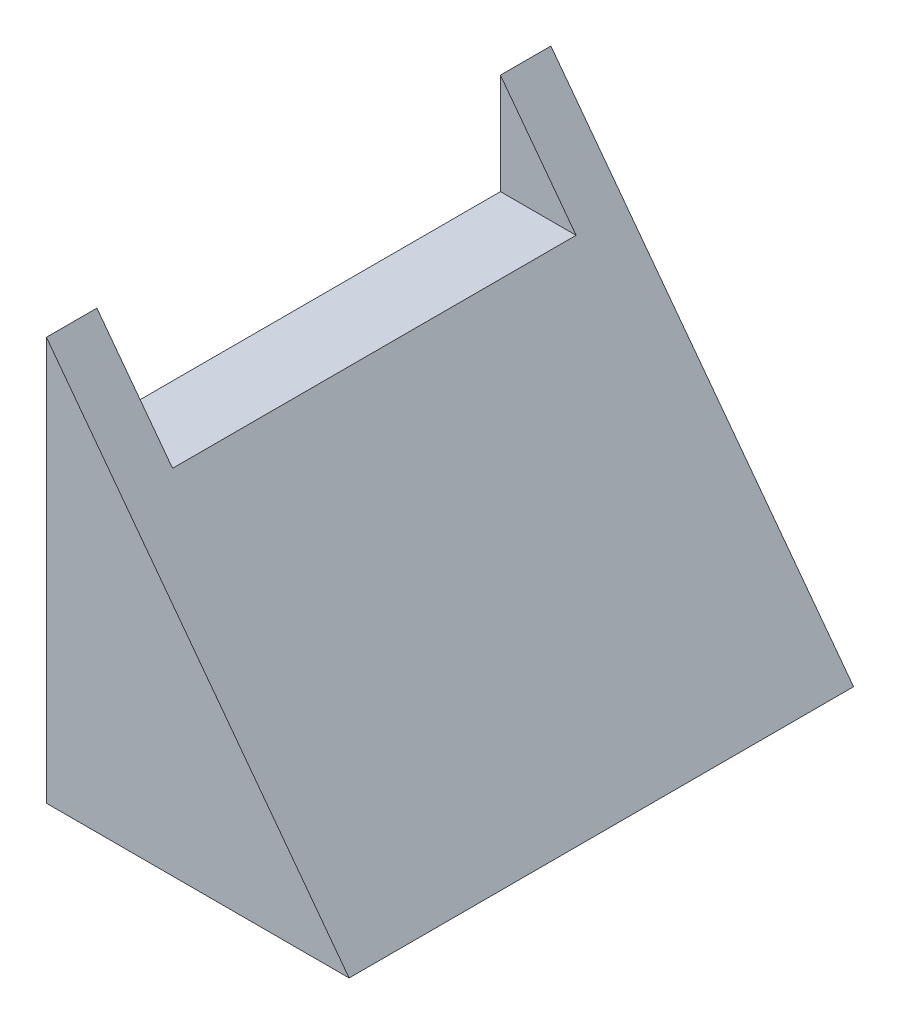
ISO-10303-21;
HEADER;
FILE_DESCRIPTION(('STEP AP214'),'2;1');
FILE_NAME('part.step','',(''),(''),'','','');
FILE_SCHEMA(('AUTOMOTIVE_DESIGN { 1 0 10303 214 1 1 1 1 }'));
ENDSEC;
DATA;
#1=APPLICATION_CONTEXT('core data for automotive mechanical design processes');
#2=APPLICATION_PROTOCOL_DEFINITION('international standard','automotive_design',2000,#1);
#3=PRODUCT_CONTEXT('',#1,'mechanical');
#4=PRODUCT('Part','Part','',(#3));
#5=PRODUCT_RELATED_PRODUCT_CATEGORY('part','',(#4));
#6=PRODUCT_DEFINITION_FORMATION('','',#4);
#7=PRODUCT_DEFINITION_CONTEXT('part definition',#1,'design');
#8=PRODUCT_DEFINITION('design','',#6,#7);
#9=PRODUCT_DEFINITION_SHAPE('','',#8);
#10=(LENGTH_UNIT() NAMED_UNIT(*) SI_UNIT(.MILLI.,.METRE.));
#11=(NAMED_UNIT(*) PLANE_ANGLE_UNIT() SI_UNIT($,.RADIAN.));
#12=(NAMED_UNIT(*) SI_UNIT($,.STERADIAN.) SOLID_ANGLE_UNIT());
#13=UNCERTAINTY_MEASURE_WITH_UNIT(LENGTH_MEASURE(1.E-05),#10,'distance_accuracy_value','');
#14=(GEOMETRIC_REPRESENTATION_CONTEXT(3) GLOBAL_UNCERTAINTY_ASSIGNED_CONTEXT((#13)) GLOBAL_UNIT_ASSIGNED_CONTEXT((#10,
#11,#12)) REPRESENTATION_CONTEXT('',''));
#15=CARTESIAN_POINT('',(0.,0.,0.));
#16=DIRECTION('',(0.,0.,1.));
#17=DIRECTION('',(1.,0.,0.));
#18=AXIS2_PLACEMENT_3D('',#15,#16,#17);
#19=CARTESIAN_POINT('',(-19.05,0.,63.5));
#20=DIRECTION('',(1.,0.,0.));
#21=DIRECTION('',(0.,1.,0.));
#22=AXIS2_PLACEMENT_3D('',#19,#20,#21);
#23=PLANE('',#22);
#24=DIRECTION('',(0.,0.,-1.));
#25=VECTOR('',#24,1.);
#26=CARTESIAN_POINT('',(-19.05,50.8,63.5));
#27=LINE('',#26,#25);
#28=CARTESIAN_POINT('',(-19.05,50.8,63.5));
#29=VERTEX_POINT('',#28);
#30=CARTESIAN_POINT('',(-19.05,50.8,57.15));
#31=VERTEX_POINT('',#30);
#32=EDGE_CURVE('E107',#29,#31,#27,.T.);
#33=ORIENTED_EDGE('',*,*,#32,.T.);
#34=DIRECTION('',(0.,1.,0.));
#35=VECTOR('',#34,1.);
#36=CARTESIAN_POINT('',(-19.05,50.8,57.15));
#37=LINE('',#36,#35);
#38=CARTESIAN_POINT('',(-19.05,38.1,57.15));
#39=VERTEX_POINT('',#38);
#40=EDGE_CURVE('E95',#39,#31,#37,.T.);
#41=ORIENTED_EDGE('',*,*,#40,.F.);
#42=DIRECTION('',(0.,0.,1.));
#43=VECTOR('',#42,1.);
#44=CARTESIAN_POINT('',(-19.05,38.1,57.15));
#45=LINE('',#44,#43);
#46=CARTESIAN_POINT('',(-19.05,38.1,6.35));
#47=VERTEX_POINT('',#46);
#48=EDGE_CURVE('E124',#47,#39,#45,.T.);
#49=ORIENTED_EDGE('',*,*,#48,.F.);
#50=DIRECTION('',(0.,-1.,0.));
#51=VECTOR('',#50,1.);
#52=CARTESIAN_POINT('',(-19.05,50.8,6.35));
#53=LINE('',#52,#51);
#54=CARTESIAN_POINT('',(-19.05,50.8,6.35));
#55=VERTEX_POINT('',#54);
#56=EDGE_CURVE('E102',#55,#47,#53,.T.);
#57=ORIENTED_EDGE('',*,*,#56,.F.);
#58=CARTESIAN_POINT('',(-19.05,50.8,0.));
#59=VERTEX_POINT('',#58);
#60=EDGE_CURVE('E74',#55,#59,#27,.T.);
#61=ORIENTED_EDGE('',*,*,#60,.T.);
#62=DIRECTION('',(0.,-1.,0.));
#63=VECTOR('',#62,1.);
#64=CARTESIAN_POINT('',(-19.05,0.,0.));
#65=LINE('',#64,#63);
#66=CARTESIAN_POINT('',(-19.05,0.,0.));
#67=VERTEX_POINT('',#66);
#68=EDGE_CURVE('E129',#59,#67,#65,.T.);
#69=ORIENTED_EDGE('',*,*,#68,.T.);
#70=DIRECTION('',(0.,0.,-1.));
#71=VECTOR('',#70,1.);
#72=CARTESIAN_POINT('',(-19.05,0.,63.5));
#73=LINE('',#72,#71);
#74=CARTESIAN_POINT('',(-19.05,0.,63.5));
#75=VERTEX_POINT('',#74);
#76=EDGE_CURVE('E115',#75,#67,#73,.T.);
#77=ORIENTED_EDGE('',*,*,#76,.F.);
#78=DIRECTION('',(0.,-1.,0.));
#79=VECTOR('',#78,1.);
#80=CARTESIAN_POINT('',(-19.05,0.,63.5));
#81=LINE('',#80,#79);
#82=EDGE_CURVE('E111',#29,#75,#81,.T.);
#83=ORIENTED_EDGE('',*,*,#82,.F.);
#84=EDGE_LOOP('',(#33,#41,#49,#57,#61,#69,#77,#83));
#85=FACE_BOUND('',#84,.T.);
#86=ADVANCED_FACE('F33',(#85),#23,.F.);
#87=CARTESIAN_POINT('',(19.05,0.,63.5));
#88=DIRECTION('',(0.,1.,0.));
#89=DIRECTION('',(-1.,0.,0.));
#90=AXIS2_PLACEMENT_3D('',#87,#88,#89);
#91=PLANE('',#90);
#92=DIRECTION('',(1.,0.,0.));
#93=VECTOR('',#92,1.);
#94=CARTESIAN_POINT('',(19.05,0.,0.));
#95=LINE('',#94,#93);
#96=CARTESIAN_POINT('',(19.05,0.,0.));
#97=VERTEX_POINT('',#96);
#98=EDGE_CURVE('E134',#67,#97,#95,.T.);
#99=ORIENTED_EDGE('',*,*,#98,.T.);
#100=DIRECTION('',(0.,0.,-1.));
#101=VECTOR('',#100,1.);
#102=CARTESIAN_POINT('',(19.05,0.,63.5));
#103=LINE('',#102,#101);
#104=CARTESIAN_POINT('',(19.05,0.,63.5));
#105=VERTEX_POINT('',#104);
#106=EDGE_CURVE('E112',#105,#97,#103,.T.);
#107=ORIENTED_EDGE('',*,*,#106,.F.);
#108=DIRECTION('',(1.,0.,0.));
#109=VECTOR('',#108,1.);
#110=CARTESIAN_POINT('',(19.05,0.,63.5));
#111=LINE('',#110,#109);
#112=EDGE_CURVE('E80',#75,#105,#111,.T.);
#113=ORIENTED_EDGE('',*,*,#112,.F.);
#114=ORIENTED_EDGE('',*,*,#76,.T.);
#115=EDGE_LOOP('',(#99,#107,#113,#114));
#116=FACE_BOUND('',#115,.T.);
#117=ADVANCED_FACE('F139',(#116),#91,.F.);
#118=CARTESIAN_POINT('',(-19.05,50.8,63.5));
#119=DIRECTION('',(-0.8,-0.6,0.));
#120=DIRECTION('',(0.6,-0.8,0.));
#121=AXIS2_PLACEMENT_3D('',#118,#119,#120);
#122=PLANE('',#121);
#123=DIRECTION('',(0.,0.,1.));
#124=VECTOR('',#123,1.);
#125=CARTESIAN_POINT('',(-9.52500000000001,38.1,63.5));
#126=LINE('',#125,#124);
#127=CARTESIAN_POINT('',(-9.525,38.1,6.35));
#128=VERTEX_POINT('',#127);
#129=CARTESIAN_POINT('',(-9.52500000000001,38.1,57.15));
#130=VERTEX_POINT('',#129);
#131=EDGE_CURVE('E40',#128,#130,#126,.T.);
#132=ORIENTED_EDGE('',*,*,#131,.T.);
#133=DIRECTION('',(-0.6,0.8,0.));
#134=VECTOR('',#133,1.);
#135=CARTESIAN_POINT('',(-19.05,50.8,57.15));
#136=LINE('',#135,#134);
#137=EDGE_CURVE('E11',#130,#31,#136,.T.);
#138=ORIENTED_EDGE('',*,*,#137,.T.);
#139=ORIENTED_EDGE('',*,*,#32,.F.);
#140=DIRECTION('',(-0.6,0.8,0.));
#141=VECTOR('',#140,1.);
#142=CARTESIAN_POINT('',(-19.05,50.8,63.5));
#143=LINE('',#142,#141);
#144=EDGE_CURVE('E56',#105,#29,#143,.T.);
#145=ORIENTED_EDGE('',*,*,#144,.F.);
#146=ORIENTED_EDGE('',*,*,#106,.T.);
#147=DIRECTION('',(-0.6,0.8,0.));
#148=VECTOR('',#147,1.);
#149=CARTESIAN_POINT('',(-19.05,50.8,0.));
#150=LINE('',#149,#148);
#151=EDGE_CURVE('E118',#97,#59,#150,.T.);
#152=ORIENTED_EDGE('',*,*,#151,.T.);
#153=ORIENTED_EDGE('',*,*,#60,.F.);
#154=DIRECTION('',(0.6,-0.8,0.));
#155=VECTOR('',#154,1.);
#156=CARTESIAN_POINT('',(-19.05,50.8,6.35));
#157=LINE('',#156,#155);
#158=EDGE_CURVE('E122',#55,#128,#157,.T.);
#159=ORIENTED_EDGE('',*,*,#158,.T.);
#160=EDGE_LOOP('',(#132,#138,#139,#145,#146,#152,#153,#159));
#161=FACE_BOUND('',#160,.T.);
#162=ADVANCED_FACE('F106',(#161),#122,.F.);
#163=CARTESIAN_POINT('',(0.,0.,63.5));
#164=DIRECTION('',(0.,0.,1.));
#165=DIRECTION('',(1.,0.,0.));
#166=AXIS2_PLACEMENT_3D('',#163,#164,#165);
#167=PLANE('',#166);
#168=ORIENTED_EDGE('',*,*,#82,.T.);
#169=ORIENTED_EDGE('',*,*,#112,.T.);
#170=ORIENTED_EDGE('',*,*,#144,.T.);
#171=EDGE_LOOP('',(#168,#169,#170));
#172=FACE_BOUND('',#171,.T.);
#173=ADVANCED_FACE('F146',(#172),#167,.T.);
#174=CARTESIAN_POINT('',(0.,0.,0.));
#175=DIRECTION('',(0.,0.,1.));
#176=DIRECTION('',(1.,0.,0.));
#177=AXIS2_PLACEMENT_3D('',#174,#175,#176);
#178=PLANE('',#177);
#179=ORIENTED_EDGE('',*,*,#68,.F.);
#180=ORIENTED_EDGE('',*,*,#151,.F.);
#181=ORIENTED_EDGE('',*,*,#98,.F.);
#182=EDGE_LOOP('',(#179,#180,#181));
#183=FACE_BOUND('',#182,.T.);
#184=ADVANCED_FACE('F138',(#183),#178,.F.);
#185=CARTESIAN_POINT('',(19.05,50.8,57.15));
#186=DIRECTION('',(0.,0.,1.));
#187=DIRECTION('',(1.,0.,0.));
#188=AXIS2_PLACEMENT_3D('',#185,#186,#187);
#189=PLANE('',#188);
#190=DIRECTION('',(-1.,0.,0.));
#191=VECTOR('',#190,1.);
#192=CARTESIAN_POINT('',(19.05,38.1,57.15));
#193=LINE('',#192,#191);
#194=EDGE_CURVE('E98',#130,#39,#193,.T.);
#195=ORIENTED_EDGE('',*,*,#194,.T.);
#196=ORIENTED_EDGE('',*,*,#40,.T.);
#197=ORIENTED_EDGE('',*,*,#137,.F.);
#198=EDGE_LOOP('',(#195,#196,#197));
#199=FACE_BOUND('',#198,.T.);
#200=ADVANCED_FACE('F96',(#199),#189,.F.);
#201=CARTESIAN_POINT('',(19.05,38.1,57.15));
#202=DIRECTION('',(0.,-1.,0.));
#203=DIRECTION('',(1.,0.,0.));
#204=AXIS2_PLACEMENT_3D('',#201,#202,#203);
#205=PLANE('',#204);
#206=DIRECTION('',(-1.,0.,0.));
#207=VECTOR('',#206,1.);
#208=CARTESIAN_POINT('',(19.05,38.1,6.35));
#209=LINE('',#208,#207);
#210=EDGE_CURVE('E47',#128,#47,#209,.T.);
#211=ORIENTED_EDGE('',*,*,#210,.T.);
#212=ORIENTED_EDGE('',*,*,#48,.T.);
#213=ORIENTED_EDGE('',*,*,#194,.F.);
#214=ORIENTED_EDGE('',*,*,#131,.F.);
#215=EDGE_LOOP('',(#211,#212,#213,#214));
#216=FACE_BOUND('',#215,.T.);
#217=ADVANCED_FACE('F156',(#216),#205,.F.);
#218=CARTESIAN_POINT('',(19.05,50.8,6.35));
#219=DIRECTION('',(0.,0.,-1.));
#220=DIRECTION('',(-1.,0.,0.));
#221=AXIS2_PLACEMENT_3D('',#218,#219,#220);
#222=PLANE('',#221);
#223=ORIENTED_EDGE('',*,*,#56,.T.);
#224=ORIENTED_EDGE('',*,*,#210,.F.);
#225=ORIENTED_EDGE('',*,*,#158,.F.);
#226=EDGE_LOOP('',(#223,#224,#225));
#227=FACE_BOUND('',#226,.T.);
#228=ADVANCED_FACE('F123',(#227),#222,.F.);
#229=CLOSED_SHELL('',(#86,#117,#162,#173,#184,#200,#217,#228));
#230=MANIFOLD_SOLID_BREP('B2',#229);
#231=ADVANCED_BREP_SHAPE_REPRESENTATION('',(#18,#230),#14);
#232=SHAPE_DEFINITION_REPRESENTATION(#9,#231);
ENDSEC;
END-ISO-10303-21;
